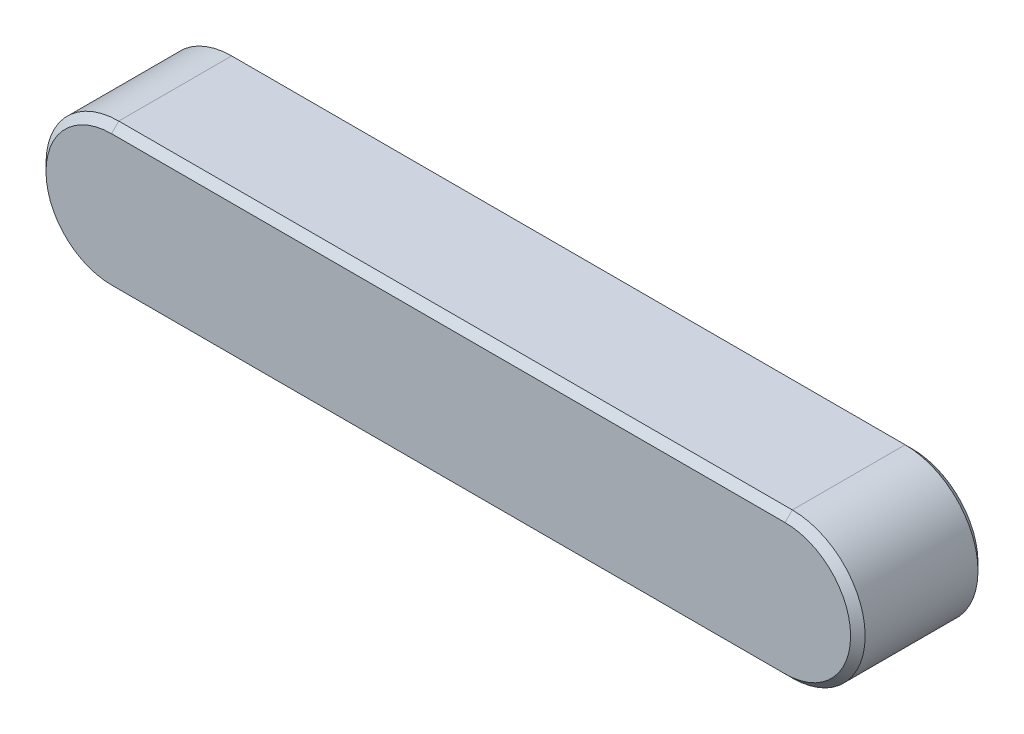
ISO-10303-21;
HEADER;
FILE_DESCRIPTION(('STEP AP214'),'2;1');
FILE_NAME('part.step','',(''),(''),'','','');
FILE_SCHEMA(('AUTOMOTIVE_DESIGN { 1 0 10303 214 1 1 1 1 }'));
ENDSEC;
DATA;
#1=APPLICATION_CONTEXT('core data for automotive mechanical design processes');
#2=APPLICATION_PROTOCOL_DEFINITION('international standard','automotive_design',2000,#1);
#3=PRODUCT_CONTEXT('',#1,'mechanical');
#4=PRODUCT('Part','Part','',(#3));
#5=PRODUCT_RELATED_PRODUCT_CATEGORY('part','',(#4));
#6=PRODUCT_DEFINITION_FORMATION('','',#4);
#7=PRODUCT_DEFINITION_CONTEXT('part definition',#1,'design');
#8=PRODUCT_DEFINITION('design','',#6,#7);
#9=PRODUCT_DEFINITION_SHAPE('','',#8);
#10=(LENGTH_UNIT() NAMED_UNIT(*) SI_UNIT(.MILLI.,.METRE.));
#11=(NAMED_UNIT(*) PLANE_ANGLE_UNIT() SI_UNIT($,.RADIAN.));
#12=(NAMED_UNIT(*) SI_UNIT($,.STERADIAN.) SOLID_ANGLE_UNIT());
#13=UNCERTAINTY_MEASURE_WITH_UNIT(LENGTH_MEASURE(1.E-05),#10,'distance_accuracy_value','');
#14=(GEOMETRIC_REPRESENTATION_CONTEXT(3) GLOBAL_UNCERTAINTY_ASSIGNED_CONTEXT((#13)) GLOBAL_UNIT_ASSIGNED_CONTEXT((#10,
#11,#12)) REPRESENTATION_CONTEXT('',''));
#15=CARTESIAN_POINT('',(0.,0.,0.));
#16=DIRECTION('',(0.,0.,1.));
#17=DIRECTION('',(1.,0.,0.));
#18=AXIS2_PLACEMENT_3D('',#15,#16,#17);
#19=CARTESIAN_POINT('',(-37.,0.,3.5));
#20=DIRECTION('',(0.,0.,-1.));
#21=DIRECTION('',(-1.,0.,0.));
#22=AXIS2_PLACEMENT_3D('',#19,#20,#21);
#23=CYLINDRICAL_SURFACE('',#22,4.);
#24=DIRECTION('',(0.,0.,-1.));
#25=VECTOR('',#24,1.);
#26=CARTESIAN_POINT('',(-37.,-4.,3.5));
#27=LINE('',#26,#25);
#28=CARTESIAN_POINT('',(-37.,-4.,3.09999999999999));
#29=VERTEX_POINT('',#28);
#30=CARTESIAN_POINT('',(-37.,-4.,-3.1));
#31=VERTEX_POINT('',#30);
#32=EDGE_CURVE('E119',#29,#31,#27,.T.);
#33=ORIENTED_EDGE('',*,*,#32,.F.);
#34=CARTESIAN_POINT('',(-37.,0.,3.09999999999999));
#35=DIRECTION('',(0.,0.,-1.));
#36=DIRECTION('',(-1.,0.,0.));
#37=AXIS2_PLACEMENT_3D('',#34,#35,#36);
#38=CIRCLE('',#37,4.);
#39=CARTESIAN_POINT('',(-37.,4.,3.09999999999999));
#40=VERTEX_POINT('',#39);
#41=EDGE_CURVE('E53',#29,#40,#38,.T.);
#42=ORIENTED_EDGE('',*,*,#41,.T.);
#43=DIRECTION('',(0.,0.,-1.));
#44=VECTOR('',#43,1.);
#45=CARTESIAN_POINT('',(-37.,4.,3.5));
#46=LINE('',#45,#44);
#47=CARTESIAN_POINT('',(-37.,4.,-3.1));
#48=VERTEX_POINT('',#47);
#49=EDGE_CURVE('E157',#40,#48,#46,.T.);
#50=ORIENTED_EDGE('',*,*,#49,.T.);
#51=CARTESIAN_POINT('',(-37.,0.,-3.1));
#52=DIRECTION('',(0.,0.,-1.));
#53=DIRECTION('',(-1.,0.,0.));
#54=AXIS2_PLACEMENT_3D('',#51,#52,#53);
#55=CIRCLE('',#54,4.);
#56=EDGE_CURVE('E107',#48,#31,#55,.F.);
#57=ORIENTED_EDGE('',*,*,#56,.T.);
#58=EDGE_LOOP('',(#33,#42,#50,#57));
#59=FACE_BOUND('',#58,.T.);
#60=ADVANCED_FACE('F30',(#59),#23,.T.);
#61=CARTESIAN_POINT('',(0.,-4.,3.5));
#62=DIRECTION('',(0.,1.,0.));
#63=DIRECTION('',(-1.,0.,0.));
#64=AXIS2_PLACEMENT_3D('',#61,#62,#63);
#65=PLANE('',#64);
#66=ORIENTED_EDGE('',*,*,#32,.T.);
#67=DIRECTION('',(1.,0.,0.));
#68=VECTOR('',#67,1.);
#69=CARTESIAN_POINT('',(0.,-4.,-3.1));
#70=LINE('',#69,#68);
#71=CARTESIAN_POINT('',(0.,-4.,-3.1));
#72=VERTEX_POINT('',#71);
#73=EDGE_CURVE('E118',#31,#72,#70,.T.);
#74=ORIENTED_EDGE('',*,*,#73,.T.);
#75=DIRECTION('',(0.,0.,-1.));
#76=VECTOR('',#75,1.);
#77=CARTESIAN_POINT('',(0.,-4.,3.5));
#78=LINE('',#77,#76);
#79=CARTESIAN_POINT('',(0.,-4.,3.09999999999999));
#80=VERTEX_POINT('',#79);
#81=EDGE_CURVE('E101',#80,#72,#78,.T.);
#82=ORIENTED_EDGE('',*,*,#81,.F.);
#83=DIRECTION('',(-1.,0.,0.));
#84=VECTOR('',#83,1.);
#85=CARTESIAN_POINT('',(0.,-4.,3.09999999999999));
#86=LINE('',#85,#84);
#87=EDGE_CURVE('E116',#80,#29,#86,.T.);
#88=ORIENTED_EDGE('',*,*,#87,.T.);
#89=EDGE_LOOP('',(#66,#74,#82,#88));
#90=FACE_BOUND('',#89,.T.);
#91=ADVANCED_FACE('F115',(#90),#65,.F.);
#92=CARTESIAN_POINT('',(0.,0.,3.5));
#93=DIRECTION('',(0.,0.,-1.));
#94=DIRECTION('',(-1.,0.,0.));
#95=AXIS2_PLACEMENT_3D('',#92,#93,#94);
#96=CYLINDRICAL_SURFACE('',#95,4.);
#97=DIRECTION('',(0.,0.,-1.));
#98=VECTOR('',#97,1.);
#99=CARTESIAN_POINT('',(0.,4.,3.5));
#100=LINE('',#99,#98);
#101=CARTESIAN_POINT('',(0.,4.,3.09999999999999));
#102=VERTEX_POINT('',#101);
#103=CARTESIAN_POINT('',(0.,4.,-3.1));
#104=VERTEX_POINT('',#103);
#105=EDGE_CURVE('E102',#102,#104,#100,.T.);
#106=ORIENTED_EDGE('',*,*,#105,.F.);
#107=CARTESIAN_POINT('',(0.,0.,3.09999999999999));
#108=DIRECTION('',(0.,0.,-1.));
#109=DIRECTION('',(-1.,0.,0.));
#110=AXIS2_PLACEMENT_3D('',#107,#108,#109);
#111=CIRCLE('',#110,4.);
#112=EDGE_CURVE('E98',#102,#80,#111,.T.);
#113=ORIENTED_EDGE('',*,*,#112,.T.);
#114=ORIENTED_EDGE('',*,*,#81,.T.);
#115=CARTESIAN_POINT('',(0.,0.,-3.1));
#116=DIRECTION('',(0.,0.,-1.));
#117=DIRECTION('',(-1.,0.,0.));
#118=AXIS2_PLACEMENT_3D('',#115,#116,#117);
#119=CIRCLE('',#118,4.);
#120=EDGE_CURVE('E108',#72,#104,#119,.F.);
#121=ORIENTED_EDGE('',*,*,#120,.T.);
#122=EDGE_LOOP('',(#106,#113,#114,#121));
#123=FACE_BOUND('',#122,.T.);
#124=ADVANCED_FACE('F100',(#123),#96,.T.);
#125=CARTESIAN_POINT('',(-37.,4.,3.5));
#126=DIRECTION('',(0.,-1.,0.));
#127=DIRECTION('',(0.,0.,-1.));
#128=AXIS2_PLACEMENT_3D('',#125,#126,#127);
#129=PLANE('',#128);
#130=ORIENTED_EDGE('',*,*,#49,.F.);
#131=DIRECTION('',(1.,0.,0.));
#132=VECTOR('',#131,1.);
#133=CARTESIAN_POINT('',(-37.,4.,3.09999999999999));
#134=LINE('',#133,#132);
#135=EDGE_CURVE('E11',#40,#102,#134,.T.);
#136=ORIENTED_EDGE('',*,*,#135,.T.);
#137=ORIENTED_EDGE('',*,*,#105,.T.);
#138=DIRECTION('',(-1.,0.,0.));
#139=VECTOR('',#138,1.);
#140=CARTESIAN_POINT('',(-37.,4.,-3.1));
#141=LINE('',#140,#139);
#142=EDGE_CURVE('E39',#104,#48,#141,.T.);
#143=ORIENTED_EDGE('',*,*,#142,.T.);
#144=EDGE_LOOP('',(#130,#136,#137,#143));
#145=FACE_BOUND('',#144,.T.);
#146=ADVANCED_FACE('F207',(#145),#129,.F.);
#147=CARTESIAN_POINT('',(-37.,0.,3.5));
#148=DIRECTION('',(0.,0.,-1.));
#149=DIRECTION('',(-1.,0.,0.));
#150=AXIS2_PLACEMENT_3D('',#147,#148,#149);
#151=PLANE('',#150);
#152=CARTESIAN_POINT('',(-37.,0.,3.5));
#153=DIRECTION('',(0.,0.,-1.));
#154=DIRECTION('',(-1.,0.,0.));
#155=AXIS2_PLACEMENT_3D('',#152,#153,#154);
#156=CIRCLE('',#155,3.6);
#157=CARTESIAN_POINT('',(-37.,3.6,3.5));
#158=VERTEX_POINT('',#157);
#159=CARTESIAN_POINT('',(-37.,-3.6,3.5));
#160=VERTEX_POINT('',#159);
#161=EDGE_CURVE('E178',#158,#160,#156,.F.);
#162=ORIENTED_EDGE('',*,*,#161,.T.);
#163=DIRECTION('',(1.,0.,0.));
#164=VECTOR('',#163,1.);
#165=CARTESIAN_POINT('',(-37.,-3.6,3.5));
#166=LINE('',#165,#164);
#167=CARTESIAN_POINT('',(0.,-3.6,3.5));
#168=VERTEX_POINT('',#167);
#169=EDGE_CURVE('E181',#160,#168,#166,.T.);
#170=ORIENTED_EDGE('',*,*,#169,.T.);
#171=CARTESIAN_POINT('',(0.,0.,3.5));
#172=DIRECTION('',(0.,0.,-1.));
#173=DIRECTION('',(-1.,0.,0.));
#174=AXIS2_PLACEMENT_3D('',#171,#172,#173);
#175=CIRCLE('',#174,3.6);
#176=CARTESIAN_POINT('',(0.,3.6,3.5));
#177=VERTEX_POINT('',#176);
#178=EDGE_CURVE('E130',#168,#177,#175,.F.);
#179=ORIENTED_EDGE('',*,*,#178,.T.);
#180=DIRECTION('',(-1.,0.,0.));
#181=VECTOR('',#180,1.);
#182=CARTESIAN_POINT('',(-37.,3.6,3.5));
#183=LINE('',#182,#181);
#184=EDGE_CURVE('E176',#177,#158,#183,.T.);
#185=ORIENTED_EDGE('',*,*,#184,.T.);
#186=EDGE_LOOP('',(#162,#170,#179,#185));
#187=FACE_BOUND('',#186,.T.);
#188=ADVANCED_FACE('F210',(#187),#151,.F.);
#189=CARTESIAN_POINT('',(-37.,0.,-3.5));
#190=DIRECTION('',(0.,0.,-1.));
#191=DIRECTION('',(-1.,0.,0.));
#192=AXIS2_PLACEMENT_3D('',#189,#190,#191);
#193=PLANE('',#192);
#194=CARTESIAN_POINT('',(0.,0.,-3.5));
#195=DIRECTION('',(0.,0.,-1.));
#196=DIRECTION('',(-1.,0.,0.));
#197=AXIS2_PLACEMENT_3D('',#194,#195,#196);
#198=CIRCLE('',#197,3.6);
#199=CARTESIAN_POINT('',(0.,3.6,-3.5));
#200=VERTEX_POINT('',#199);
#201=CARTESIAN_POINT('',(0.,-3.6,-3.5));
#202=VERTEX_POINT('',#201);
#203=EDGE_CURVE('E171',#200,#202,#198,.T.);
#204=ORIENTED_EDGE('',*,*,#203,.T.);
#205=DIRECTION('',(-1.,0.,0.));
#206=VECTOR('',#205,1.);
#207=CARTESIAN_POINT('',(-37.,-3.6,-3.5));
#208=LINE('',#207,#206);
#209=CARTESIAN_POINT('',(-37.,-3.6,-3.5));
#210=VERTEX_POINT('',#209);
#211=EDGE_CURVE('E173',#202,#210,#208,.T.);
#212=ORIENTED_EDGE('',*,*,#211,.T.);
#213=CARTESIAN_POINT('',(-37.,0.,-3.5));
#214=DIRECTION('',(0.,0.,-1.));
#215=DIRECTION('',(-1.,0.,0.));
#216=AXIS2_PLACEMENT_3D('',#213,#214,#215);
#217=CIRCLE('',#216,3.6);
#218=CARTESIAN_POINT('',(-37.,3.6,-3.5));
#219=VERTEX_POINT('',#218);
#220=EDGE_CURVE('E169',#210,#219,#217,.T.);
#221=ORIENTED_EDGE('',*,*,#220,.T.);
#222=DIRECTION('',(1.,0.,0.));
#223=VECTOR('',#222,1.);
#224=CARTESIAN_POINT('',(0.,3.6,-3.5));
#225=LINE('',#224,#223);
#226=EDGE_CURVE('E167',#219,#200,#225,.T.);
#227=ORIENTED_EDGE('',*,*,#226,.T.);
#228=EDGE_LOOP('',(#204,#212,#221,#227));
#229=FACE_BOUND('',#228,.T.);
#230=ADVANCED_FACE('F211',(#229),#193,.T.);
#231=CARTESIAN_POINT('',(-37.,4.,-3.1));
#232=DIRECTION('',(0.,0.707106781186547,-0.707106781186547));
#233=DIRECTION('',(0.,0.707106781186548,0.707106781186548));
#234=AXIS2_PLACEMENT_3D('',#231,#232,#233);
#235=PLANE('',#234);
#236=DIRECTION('',(0.,0.707106781186547,0.707106781186547));
#237=VECTOR('',#236,1.);
#238=CARTESIAN_POINT('',(0.,3.6,-3.5));
#239=LINE('',#238,#237);
#240=EDGE_CURVE('E149',#200,#104,#239,.T.);
#241=ORIENTED_EDGE('',*,*,#240,.F.);
#242=ORIENTED_EDGE('',*,*,#226,.F.);
#243=DIRECTION('',(0.,-0.707106781186547,-0.707106781186547));
#244=VECTOR('',#243,1.);
#245=CARTESIAN_POINT('',(-37.,4.,-3.1));
#246=LINE('',#245,#244);
#247=EDGE_CURVE('E136',#48,#219,#246,.T.);
#248=ORIENTED_EDGE('',*,*,#247,.F.);
#249=ORIENTED_EDGE('',*,*,#142,.F.);
#250=EDGE_LOOP('',(#241,#242,#248,#249));
#251=FACE_BOUND('',#250,.T.);
#252=ADVANCED_FACE('F214',(#251),#235,.T.);
#253=CARTESIAN_POINT('',(-37.,0.,-3.1));
#254=DIRECTION('',(0.,0.,1.));
#255=DIRECTION('',(1.,0.,0.));
#256=AXIS2_PLACEMENT_3D('',#253,#254,#255);
#257=CONICAL_SURFACE('',#256,4.,0.785398163397448);
#258=ORIENTED_EDGE('',*,*,#247,.T.);
#259=ORIENTED_EDGE('',*,*,#220,.F.);
#260=DIRECTION('',(0.,0.707106781186547,-0.707106781186547));
#261=VECTOR('',#260,1.);
#262=CARTESIAN_POINT('',(-37.,-4.,-3.1));
#263=LINE('',#262,#261);
#264=EDGE_CURVE('E143',#31,#210,#263,.T.);
#265=ORIENTED_EDGE('',*,*,#264,.F.);
#266=ORIENTED_EDGE('',*,*,#56,.F.);
#267=EDGE_LOOP('',(#258,#259,#265,#266));
#268=FACE_BOUND('',#267,.T.);
#269=ADVANCED_FACE('F186',(#268),#257,.T.);
#270=CARTESIAN_POINT('',(0.,0.,-3.1));
#271=DIRECTION('',(0.,0.,1.));
#272=DIRECTION('',(1.,0.,0.));
#273=AXIS2_PLACEMENT_3D('',#270,#271,#272);
#274=CONICAL_SURFACE('',#273,4.,0.785398163397448);
#275=ORIENTED_EDGE('',*,*,#240,.T.);
#276=ORIENTED_EDGE('',*,*,#120,.F.);
#277=DIRECTION('',(0.,-0.707106781186547,0.707106781186547));
#278=VECTOR('',#277,1.);
#279=CARTESIAN_POINT('',(0.,-3.6,-3.5));
#280=LINE('',#279,#278);
#281=EDGE_CURVE('E139',#202,#72,#280,.T.);
#282=ORIENTED_EDGE('',*,*,#281,.F.);
#283=ORIENTED_EDGE('',*,*,#203,.F.);
#284=EDGE_LOOP('',(#275,#276,#282,#283));
#285=FACE_BOUND('',#284,.T.);
#286=ADVANCED_FACE('F189',(#285),#274,.T.);
#287=CARTESIAN_POINT('',(0.,-4.,-3.1));
#288=DIRECTION('',(0.,-0.707106781186547,-0.707106781186547));
#289=DIRECTION('',(0.,0.707106781186548,-0.707106781186548));
#290=AXIS2_PLACEMENT_3D('',#287,#288,#289);
#291=PLANE('',#290);
#292=ORIENTED_EDGE('',*,*,#264,.T.);
#293=ORIENTED_EDGE('',*,*,#211,.F.);
#294=ORIENTED_EDGE('',*,*,#281,.T.);
#295=ORIENTED_EDGE('',*,*,#73,.F.);
#296=EDGE_LOOP('',(#292,#293,#294,#295));
#297=FACE_BOUND('',#296,.T.);
#298=ADVANCED_FACE('F187',(#297),#291,.T.);
#299=CARTESIAN_POINT('',(-37.,3.6,3.5));
#300=DIRECTION('',(0.,-0.707106781186554,-0.707106781186541));
#301=DIRECTION('',(0.,0.707106781186541,-0.707106781186554));
#302=AXIS2_PLACEMENT_3D('',#299,#300,#301);
#303=PLANE('',#302);
#304=DIRECTION('',(0.,-0.707106781186541,0.707106781186554));
#305=VECTOR('',#304,1.);
#306=CARTESIAN_POINT('',(0.,4.,3.09999999999999));
#307=LINE('',#306,#305);
#308=EDGE_CURVE('E133',#102,#177,#307,.T.);
#309=ORIENTED_EDGE('',*,*,#308,.F.);
#310=ORIENTED_EDGE('',*,*,#135,.F.);
#311=DIRECTION('',(0.,0.707106781186541,-0.707106781186554));
#312=VECTOR('',#311,1.);
#313=CARTESIAN_POINT('',(-37.,3.6,3.5));
#314=LINE('',#313,#312);
#315=EDGE_CURVE('E34',#158,#40,#314,.T.);
#316=ORIENTED_EDGE('',*,*,#315,.F.);
#317=ORIENTED_EDGE('',*,*,#184,.F.);
#318=EDGE_LOOP('',(#309,#310,#316,#317));
#319=FACE_BOUND('',#318,.T.);
#320=ADVANCED_FACE('F32',(#319),#303,.F.);
#321=CARTESIAN_POINT('',(-37.,0.,3.5));
#322=DIRECTION('',(0.,0.,-1.));
#323=DIRECTION('',(-1.,0.,0.));
#324=AXIS2_PLACEMENT_3D('',#321,#322,#323);
#325=CONICAL_SURFACE('',#324,3.6,0.78539816339744);
#326=ORIENTED_EDGE('',*,*,#315,.T.);
#327=ORIENTED_EDGE('',*,*,#41,.F.);
#328=DIRECTION('',(0.,-0.707106781186541,-0.707106781186554));
#329=VECTOR('',#328,1.);
#330=CARTESIAN_POINT('',(-37.,-3.6,3.5));
#331=LINE('',#330,#329);
#332=EDGE_CURVE('E127',#160,#29,#331,.T.);
#333=ORIENTED_EDGE('',*,*,#332,.F.);
#334=ORIENTED_EDGE('',*,*,#161,.F.);
#335=EDGE_LOOP('',(#326,#327,#333,#334));
#336=FACE_BOUND('',#335,.T.);
#337=ADVANCED_FACE('F195',(#336),#325,.T.);
#338=CARTESIAN_POINT('',(0.,0.,3.5));
#339=DIRECTION('',(0.,0.,-1.));
#340=DIRECTION('',(-1.,0.,0.));
#341=AXIS2_PLACEMENT_3D('',#338,#339,#340);
#342=CONICAL_SURFACE('',#341,3.6,0.78539816339744);
#343=ORIENTED_EDGE('',*,*,#308,.T.);
#344=ORIENTED_EDGE('',*,*,#178,.F.);
#345=DIRECTION('',(0.,0.707106781186541,0.707106781186554));
#346=VECTOR('',#345,1.);
#347=CARTESIAN_POINT('',(0.,-4.,3.09999999999999));
#348=LINE('',#347,#346);
#349=EDGE_CURVE('E124',#80,#168,#348,.T.);
#350=ORIENTED_EDGE('',*,*,#349,.F.);
#351=ORIENTED_EDGE('',*,*,#112,.F.);
#352=EDGE_LOOP('',(#343,#344,#350,#351));
#353=FACE_BOUND('',#352,.T.);
#354=ADVANCED_FACE('F129',(#353),#342,.T.);
#355=CARTESIAN_POINT('',(-37.,-3.6,3.5));
#356=DIRECTION('',(0.,0.707106781186554,-0.707106781186541));
#357=DIRECTION('',(0.,0.707106781186541,0.707106781186554));
#358=AXIS2_PLACEMENT_3D('',#355,#356,#357);
#359=PLANE('',#358);
#360=ORIENTED_EDGE('',*,*,#332,.T.);
#361=ORIENTED_EDGE('',*,*,#87,.F.);
#362=ORIENTED_EDGE('',*,*,#349,.T.);
#363=ORIENTED_EDGE('',*,*,#169,.F.);
#364=EDGE_LOOP('',(#360,#361,#362,#363));
#365=FACE_BOUND('',#364,.T.);
#366=ADVANCED_FACE('F122',(#365),#359,.F.);
#367=CLOSED_SHELL('',(#60,#91,#124,#146,#188,#230,#252,#269,#286,#298,#320,#337,#354,#366));
#368=MANIFOLD_SOLID_BREP('B2',#367);
#369=ADVANCED_BREP_SHAPE_REPRESENTATION('',(#18,#368),#14);
#370=SHAPE_DEFINITION_REPRESENTATION(#9,#369);
ENDSEC;
END-ISO-10303-21;
